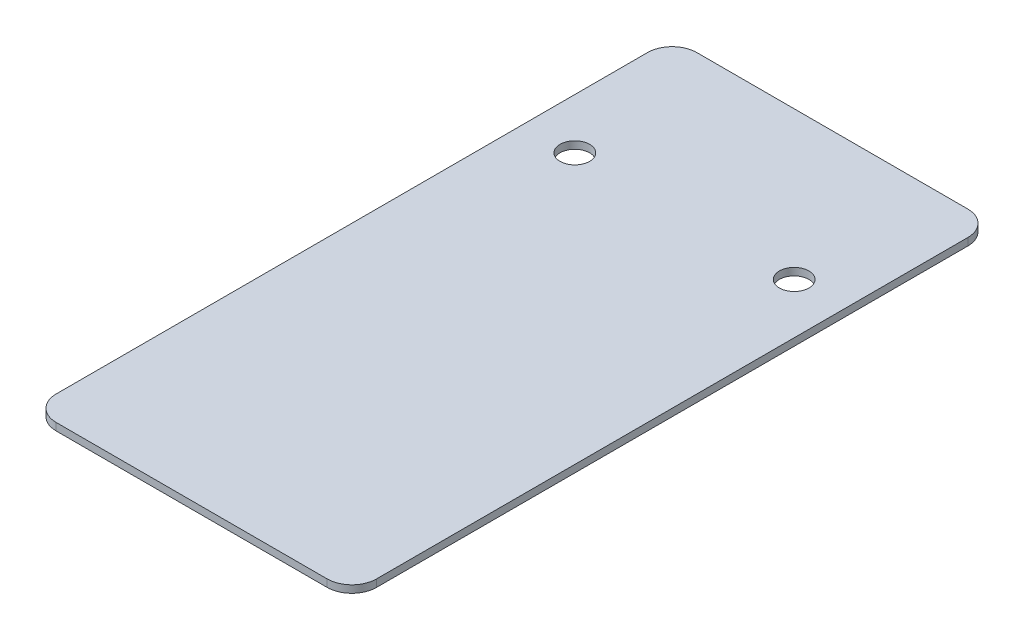
ISO-10303-21;
HEADER;
FILE_DESCRIPTION(('STEP AP214'),'2;1');
FILE_NAME('part.step','',(''),(''),'','','');
FILE_SCHEMA(('AUTOMOTIVE_DESIGN { 1 0 10303 214 1 1 1 1 }'));
ENDSEC;
DATA;
#1=APPLICATION_CONTEXT('core data for automotive mechanical design processes');
#2=APPLICATION_PROTOCOL_DEFINITION('international standard','automotive_design',2000,#1);
#3=PRODUCT_CONTEXT('',#1,'mechanical');
#4=PRODUCT('Part','Part','',(#3));
#5=PRODUCT_RELATED_PRODUCT_CATEGORY('part','',(#4));
#6=PRODUCT_DEFINITION_FORMATION('','',#4);
#7=PRODUCT_DEFINITION_CONTEXT('part definition',#1,'design');
#8=PRODUCT_DEFINITION('design','',#6,#7);
#9=PRODUCT_DEFINITION_SHAPE('','',#8);
#10=(LENGTH_UNIT() NAMED_UNIT(*) SI_UNIT(.MILLI.,.METRE.));
#11=(NAMED_UNIT(*) PLANE_ANGLE_UNIT() SI_UNIT($,.RADIAN.));
#12=(NAMED_UNIT(*) SI_UNIT($,.STERADIAN.) SOLID_ANGLE_UNIT());
#13=UNCERTAINTY_MEASURE_WITH_UNIT(LENGTH_MEASURE(1.E-05),#10,'distance_accuracy_value','');
#14=(GEOMETRIC_REPRESENTATION_CONTEXT(3) GLOBAL_UNCERTAINTY_ASSIGNED_CONTEXT((#13)) GLOBAL_UNIT_ASSIGNED_CONTEXT((#10,
#11,#12)) REPRESENTATION_CONTEXT('',''));
#15=CARTESIAN_POINT('',(0.,0.,0.));
#16=DIRECTION('',(0.,0.,1.));
#17=DIRECTION('',(1.,0.,0.));
#18=AXIS2_PLACEMENT_3D('',#15,#16,#17);
#19=CARTESIAN_POINT('',(65.,3.,60.));
#20=DIRECTION('',(-1.,0.,0.));
#21=DIRECTION('',(0.,0.,1.));
#22=AXIS2_PLACEMENT_3D('',#19,#20,#21);
#23=PLANE('',#22);
#24=DIRECTION('',(0.,0.,-1.));
#25=VECTOR('',#24,1.);
#26=CARTESIAN_POINT('',(65.,3.,60.));
#27=LINE('',#26,#25);
#28=CARTESIAN_POINT('',(65.,3.,190.));
#29=VERTEX_POINT('',#28);
#30=CARTESIAN_POINT('',(65.,3.,-50.));
#31=VERTEX_POINT('',#30);
#32=EDGE_CURVE('E143',#29,#31,#27,.T.);
#33=ORIENTED_EDGE('',*,*,#32,.F.);
#34=DIRECTION('',(0.,1.,0.));
#35=VECTOR('',#34,1.);
#36=CARTESIAN_POINT('',(65.,0.,190.));
#37=LINE('',#36,#35);
#38=CARTESIAN_POINT('',(65.,0.,190.));
#39=VERTEX_POINT('',#38);
#40=EDGE_CURVE('E173',#29,#39,#37,.F.);
#41=ORIENTED_EDGE('',*,*,#40,.T.);
#42=DIRECTION('',(0.,0.,-1.));
#43=VECTOR('',#42,1.);
#44=CARTESIAN_POINT('',(65.,0.,60.));
#45=LINE('',#44,#43);
#46=CARTESIAN_POINT('',(65.,0.,-50.));
#47=VERTEX_POINT('',#46);
#48=EDGE_CURVE('E142',#39,#47,#45,.T.);
#49=ORIENTED_EDGE('',*,*,#48,.T.);
#50=DIRECTION('',(0.,-1.,0.));
#51=VECTOR('',#50,1.);
#52=CARTESIAN_POINT('',(65.,3.,-50.));
#53=LINE('',#52,#51);
#54=EDGE_CURVE('E171',#47,#31,#53,.F.);
#55=ORIENTED_EDGE('',*,*,#54,.T.);
#56=EDGE_LOOP('',(#33,#41,#49,#55));
#57=FACE_BOUND('',#56,.T.);
#58=ADVANCED_FACE('F33',(#57),#23,.F.);
#59=CARTESIAN_POINT('',(-65.,3.,-60.));
#60=DIRECTION('',(0.,0.,1.));
#61=DIRECTION('',(1.,0.,0.));
#62=AXIS2_PLACEMENT_3D('',#59,#60,#61);
#63=PLANE('',#62);
#64=DIRECTION('',(-1.,0.,0.));
#65=VECTOR('',#64,1.);
#66=CARTESIAN_POINT('',(-65.,3.,-60.));
#67=LINE('',#66,#65);
#68=CARTESIAN_POINT('',(55.,3.,-60.));
#69=VERTEX_POINT('',#68);
#70=CARTESIAN_POINT('',(-55.,3.,-60.));
#71=VERTEX_POINT('',#70);
#72=EDGE_CURVE('E145',#69,#71,#67,.T.);
#73=ORIENTED_EDGE('',*,*,#72,.F.);
#74=DIRECTION('',(0.,-1.,0.));
#75=VECTOR('',#74,1.);
#76=CARTESIAN_POINT('',(55.,3.,-60.));
#77=LINE('',#76,#75);
#78=CARTESIAN_POINT('',(55.,0.,-60.));
#79=VERTEX_POINT('',#78);
#80=EDGE_CURVE('E11',#69,#79,#77,.T.);
#81=ORIENTED_EDGE('',*,*,#80,.T.);
#82=DIRECTION('',(-1.,0.,0.));
#83=VECTOR('',#82,1.);
#84=CARTESIAN_POINT('',(-65.,0.,-60.));
#85=LINE('',#84,#83);
#86=CARTESIAN_POINT('',(-55.,0.,-60.));
#87=VERTEX_POINT('',#86);
#88=EDGE_CURVE('E153',#79,#87,#85,.T.);
#89=ORIENTED_EDGE('',*,*,#88,.T.);
#90=DIRECTION('',(0.,-1.,0.));
#91=VECTOR('',#90,1.);
#92=CARTESIAN_POINT('',(-55.,3.,-60.));
#93=LINE('',#92,#91);
#94=EDGE_CURVE('E41',#87,#71,#93,.F.);
#95=ORIENTED_EDGE('',*,*,#94,.T.);
#96=EDGE_LOOP('',(#73,#81,#89,#95));
#97=FACE_BOUND('',#96,.T.);
#98=ADVANCED_FACE('F188',(#97),#63,.F.);
#99=CARTESIAN_POINT('',(-65.,3.,60.));
#100=DIRECTION('',(1.,0.,0.));
#101=DIRECTION('',(0.,0.,-1.));
#102=AXIS2_PLACEMENT_3D('',#99,#100,#101);
#103=PLANE('',#102);
#104=DIRECTION('',(0.,0.,1.));
#105=VECTOR('',#104,1.);
#106=CARTESIAN_POINT('',(-65.,0.,60.));
#107=LINE('',#106,#105);
#108=CARTESIAN_POINT('',(-65.,0.,-50.));
#109=VERTEX_POINT('',#108);
#110=CARTESIAN_POINT('',(-65.,0.,190.));
#111=VERTEX_POINT('',#110);
#112=EDGE_CURVE('E146',#109,#111,#107,.T.);
#113=ORIENTED_EDGE('',*,*,#112,.T.);
#114=DIRECTION('',(0.,-1.,0.));
#115=VECTOR('',#114,1.);
#116=CARTESIAN_POINT('',(-65.,3.,190.));
#117=LINE('',#116,#115);
#118=CARTESIAN_POINT('',(-65.,3.,190.));
#119=VERTEX_POINT('',#118);
#120=EDGE_CURVE('E104',#111,#119,#117,.F.);
#121=ORIENTED_EDGE('',*,*,#120,.T.);
#122=DIRECTION('',(0.,0.,1.));
#123=VECTOR('',#122,1.);
#124=CARTESIAN_POINT('',(-65.,3.,60.));
#125=LINE('',#124,#123);
#126=CARTESIAN_POINT('',(-65.,3.,-50.));
#127=VERTEX_POINT('',#126);
#128=EDGE_CURVE('E148',#127,#119,#125,.T.);
#129=ORIENTED_EDGE('',*,*,#128,.F.);
#130=DIRECTION('',(0.,-1.,0.));
#131=VECTOR('',#130,1.);
#132=CARTESIAN_POINT('',(-65.,3.,-50.));
#133=LINE('',#132,#131);
#134=EDGE_CURVE('E109',#127,#109,#133,.T.);
#135=ORIENTED_EDGE('',*,*,#134,.T.);
#136=EDGE_LOOP('',(#113,#121,#129,#135));
#137=FACE_BOUND('',#136,.T.);
#138=ADVANCED_FACE('F186',(#137),#103,.F.);
#139=CARTESIAN_POINT('',(0.,3.,0.));
#140=DIRECTION('',(0.,-1.,0.));
#141=DIRECTION('',(0.,0.,-1.));
#142=AXIS2_PLACEMENT_3D('',#139,#140,#141);
#143=PLANE('',#142);
#144=CARTESIAN_POINT('',(-44.5,3.,0.));
#145=DIRECTION('',(0.,-1.,0.));
#146=DIRECTION('',(0.,0.,-1.));
#147=AXIS2_PLACEMENT_3D('',#144,#145,#146);
#148=CIRCLE('',#147,6.);
#149=CARTESIAN_POINT('',(-44.5,3.,-6.));
#150=VERTEX_POINT('',#149);
#151=EDGE_CURVE('E133',#150,#150,#148,.F.);
#152=ORIENTED_EDGE('',*,*,#151,.F.);
#153=EDGE_LOOP('',(#152));
#154=FACE_BOUND('',#153,.T.);
#155=CARTESIAN_POINT('',(44.5,3.,0.));
#156=DIRECTION('',(0.,-1.,0.));
#157=DIRECTION('',(0.,0.,-1.));
#158=AXIS2_PLACEMENT_3D('',#155,#156,#157);
#159=CIRCLE('',#158,6.);
#160=CARTESIAN_POINT('',(44.5,3.,-6.));
#161=VERTEX_POINT('',#160);
#162=EDGE_CURVE('E139',#161,#161,#159,.T.);
#163=ORIENTED_EDGE('',*,*,#162,.T.);
#164=EDGE_LOOP('',(#163));
#165=FACE_BOUND('',#164,.T.);
#166=ORIENTED_EDGE('',*,*,#128,.T.);
#167=CARTESIAN_POINT('',(-55.,3.,190.));
#168=DIRECTION('',(0.,-1.,0.));
#169=DIRECTION('',(0.,0.,-1.));
#170=AXIS2_PLACEMENT_3D('',#167,#168,#169);
#171=CIRCLE('',#170,10.);
#172=CARTESIAN_POINT('',(-55.,3.,200.));
#173=VERTEX_POINT('',#172);
#174=EDGE_CURVE('E169',#119,#173,#171,.F.);
#175=ORIENTED_EDGE('',*,*,#174,.T.);
#176=DIRECTION('',(-1.,0.,0.));
#177=VECTOR('',#176,1.);
#178=CARTESIAN_POINT('',(65.,3.,200.));
#179=LINE('',#178,#177);
#180=CARTESIAN_POINT('',(55.,3.,200.));
#181=VERTEX_POINT('',#180);
#182=EDGE_CURVE('E120',#181,#173,#179,.T.);
#183=ORIENTED_EDGE('',*,*,#182,.F.);
#184=CARTESIAN_POINT('',(55.,3.,190.));
#185=DIRECTION('',(0.,-1.,0.));
#186=DIRECTION('',(0.,0.,-1.));
#187=AXIS2_PLACEMENT_3D('',#184,#185,#186);
#188=CIRCLE('',#187,10.);
#189=EDGE_CURVE('E167',#181,#29,#188,.F.);
#190=ORIENTED_EDGE('',*,*,#189,.T.);
#191=ORIENTED_EDGE('',*,*,#32,.T.);
#192=CARTESIAN_POINT('',(55.,3.,-50.));
#193=DIRECTION('',(0.,-1.,0.));
#194=DIRECTION('',(0.,0.,-1.));
#195=AXIS2_PLACEMENT_3D('',#192,#193,#194);
#196=CIRCLE('',#195,10.);
#197=EDGE_CURVE('E54',#31,#69,#196,.F.);
#198=ORIENTED_EDGE('',*,*,#197,.T.);
#199=ORIENTED_EDGE('',*,*,#72,.T.);
#200=CARTESIAN_POINT('',(-55.,3.,-50.));
#201=DIRECTION('',(0.,-1.,0.));
#202=DIRECTION('',(0.,0.,-1.));
#203=AXIS2_PLACEMENT_3D('',#200,#201,#202);
#204=CIRCLE('',#203,10.);
#205=EDGE_CURVE('E164',#71,#127,#204,.F.);
#206=ORIENTED_EDGE('',*,*,#205,.T.);
#207=EDGE_LOOP('',(#166,#175,#183,#190,#191,#198,#199,#206));
#208=FACE_BOUND('',#207,.T.);
#209=ADVANCED_FACE('F181',(#154,#165,#208),#143,.F.);
#210=CARTESIAN_POINT('',(0.,0.,0.));
#211=DIRECTION('',(0.,-1.,0.));
#212=DIRECTION('',(0.,0.,-1.));
#213=AXIS2_PLACEMENT_3D('',#210,#211,#212);
#214=PLANE('',#213);
#215=CARTESIAN_POINT('',(-44.5,0.,0.));
#216=DIRECTION('',(0.,-1.,0.));
#217=DIRECTION('',(0.,0.,1.));
#218=AXIS2_PLACEMENT_3D('',#215,#216,#217);
#219=CIRCLE('',#218,6.);
#220=CARTESIAN_POINT('',(-44.5,0.,6.));
#221=VERTEX_POINT('',#220);
#222=EDGE_CURVE('E128',#221,#221,#219,.T.);
#223=ORIENTED_EDGE('',*,*,#222,.F.);
#224=EDGE_LOOP('',(#223));
#225=FACE_BOUND('',#224,.T.);
#226=CARTESIAN_POINT('',(44.5,0.,0.));
#227=DIRECTION('',(0.,1.,0.));
#228=DIRECTION('',(0.,0.,1.));
#229=AXIS2_PLACEMENT_3D('',#226,#227,#228);
#230=CIRCLE('',#229,6.);
#231=CARTESIAN_POINT('',(44.5,0.,6.));
#232=VERTEX_POINT('',#231);
#233=EDGE_CURVE('E136',#232,#232,#230,.T.);
#234=ORIENTED_EDGE('',*,*,#233,.T.);
#235=EDGE_LOOP('',(#234));
#236=FACE_BOUND('',#235,.T.);
#237=DIRECTION('',(1.,0.,0.));
#238=VECTOR('',#237,1.);
#239=CARTESIAN_POINT('',(-65.,0.,200.));
#240=LINE('',#239,#238);
#241=CARTESIAN_POINT('',(-55.,0.,200.));
#242=VERTEX_POINT('',#241);
#243=CARTESIAN_POINT('',(55.,0.,200.));
#244=VERTEX_POINT('',#243);
#245=EDGE_CURVE('E117',#242,#244,#240,.T.);
#246=ORIENTED_EDGE('',*,*,#245,.F.);
#247=CARTESIAN_POINT('',(-55.,0.,190.));
#248=DIRECTION('',(0.,-1.,0.));
#249=DIRECTION('',(0.,0.,-1.));
#250=AXIS2_PLACEMENT_3D('',#247,#248,#249);
#251=CIRCLE('',#250,10.);
#252=EDGE_CURVE('E99',#242,#111,#251,.T.);
#253=ORIENTED_EDGE('',*,*,#252,.T.);
#254=ORIENTED_EDGE('',*,*,#112,.F.);
#255=CARTESIAN_POINT('',(-55.,0.,-50.));
#256=DIRECTION('',(0.,-1.,0.));
#257=DIRECTION('',(0.,0.,-1.));
#258=AXIS2_PLACEMENT_3D('',#255,#256,#257);
#259=CIRCLE('',#258,10.);
#260=EDGE_CURVE('E121',#109,#87,#259,.T.);
#261=ORIENTED_EDGE('',*,*,#260,.T.);
#262=ORIENTED_EDGE('',*,*,#88,.F.);
#263=CARTESIAN_POINT('',(55.,0.,-50.));
#264=DIRECTION('',(0.,-1.,0.));
#265=DIRECTION('',(0.,0.,-1.));
#266=AXIS2_PLACEMENT_3D('',#263,#264,#265);
#267=CIRCLE('',#266,10.);
#268=EDGE_CURVE('E158',#79,#47,#267,.T.);
#269=ORIENTED_EDGE('',*,*,#268,.T.);
#270=ORIENTED_EDGE('',*,*,#48,.F.);
#271=CARTESIAN_POINT('',(55.,0.,190.));
#272=DIRECTION('',(0.,-1.,0.));
#273=DIRECTION('',(0.,0.,-1.));
#274=AXIS2_PLACEMENT_3D('',#271,#272,#273);
#275=CIRCLE('',#274,10.);
#276=EDGE_CURVE('E110',#39,#244,#275,.T.);
#277=ORIENTED_EDGE('',*,*,#276,.T.);
#278=EDGE_LOOP('',(#246,#253,#254,#261,#262,#269,#270,#277));
#279=FACE_BOUND('',#278,.T.);
#280=ADVANCED_FACE('F124',(#225,#236,#279),#214,.T.);
#281=CARTESIAN_POINT('',(44.5,0.,0.));
#282=DIRECTION('',(0.,1.,0.));
#283=DIRECTION('',(0.,0.,1.));
#284=AXIS2_PLACEMENT_3D('',#281,#282,#283);
#285=CYLINDRICAL_SURFACE('',#284,6.);
#286=ORIENTED_EDGE('',*,*,#233,.F.);
#287=EDGE_LOOP('',(#286));
#288=FACE_BOUND('',#287,.T.);
#289=ORIENTED_EDGE('',*,*,#162,.F.);
#290=EDGE_LOOP('',(#289));
#291=FACE_BOUND('',#290,.T.);
#292=ADVANCED_FACE('F217',(#288,#291),#285,.F.);
#293=CARTESIAN_POINT('',(-44.5,0.,0.));
#294=DIRECTION('',(0.,1.,0.));
#295=DIRECTION('',(0.,0.,1.));
#296=AXIS2_PLACEMENT_3D('',#293,#294,#295);
#297=CYLINDRICAL_SURFACE('',#296,6.);
#298=ORIENTED_EDGE('',*,*,#222,.T.);
#299=EDGE_LOOP('',(#298));
#300=FACE_BOUND('',#299,.T.);
#301=ORIENTED_EDGE('',*,*,#151,.T.);
#302=EDGE_LOOP('',(#301));
#303=FACE_BOUND('',#302,.T.);
#304=ADVANCED_FACE('F212',(#300,#303),#297,.F.);
#305=CARTESIAN_POINT('',(0.,0.,200.));
#306=DIRECTION('',(0.,0.,1.));
#307=DIRECTION('',(1.,0.,0.));
#308=AXIS2_PLACEMENT_3D('',#305,#306,#307);
#309=PLANE('',#308);
#310=ORIENTED_EDGE('',*,*,#182,.T.);
#311=DIRECTION('',(0.,-1.,0.));
#312=VECTOR('',#311,1.);
#313=CARTESIAN_POINT('',(-55.,0.,200.));
#314=LINE('',#313,#312);
#315=EDGE_CURVE('E103',#173,#242,#314,.T.);
#316=ORIENTED_EDGE('',*,*,#315,.T.);
#317=ORIENTED_EDGE('',*,*,#245,.T.);
#318=DIRECTION('',(0.,1.,0.));
#319=VECTOR('',#318,1.);
#320=CARTESIAN_POINT('',(55.,3.,200.));
#321=LINE('',#320,#319);
#322=EDGE_CURVE('E122',#244,#181,#321,.T.);
#323=ORIENTED_EDGE('',*,*,#322,.T.);
#324=EDGE_LOOP('',(#310,#316,#317,#323));
#325=FACE_BOUND('',#324,.T.);
#326=ADVANCED_FACE('F115',(#325),#309,.T.);
#327=CARTESIAN_POINT('',(-55.,0.,190.));
#328=DIRECTION('',(0.,1.,0.));
#329=DIRECTION('',(0.,0.,1.));
#330=AXIS2_PLACEMENT_3D('',#327,#328,#329);
#331=CYLINDRICAL_SURFACE('',#330,10.);
#332=ORIENTED_EDGE('',*,*,#174,.F.);
#333=ORIENTED_EDGE('',*,*,#120,.F.);
#334=ORIENTED_EDGE('',*,*,#252,.F.);
#335=ORIENTED_EDGE('',*,*,#315,.F.);
#336=EDGE_LOOP('',(#332,#333,#334,#335));
#337=FACE_BOUND('',#336,.T.);
#338=ADVANCED_FACE('F102',(#337),#331,.T.);
#339=CARTESIAN_POINT('',(55.,0.,190.));
#340=DIRECTION('',(0.,-1.,0.));
#341=DIRECTION('',(0.,0.,-1.));
#342=AXIS2_PLACEMENT_3D('',#339,#340,#341);
#343=CYLINDRICAL_SURFACE('',#342,10.);
#344=ORIENTED_EDGE('',*,*,#276,.F.);
#345=ORIENTED_EDGE('',*,*,#40,.F.);
#346=ORIENTED_EDGE('',*,*,#189,.F.);
#347=ORIENTED_EDGE('',*,*,#322,.F.);
#348=EDGE_LOOP('',(#344,#345,#346,#347));
#349=FACE_BOUND('',#348,.T.);
#350=ADVANCED_FACE('F180',(#349),#343,.T.);
#351=CARTESIAN_POINT('',(55.,3.,-50.));
#352=DIRECTION('',(0.,-1.,0.));
#353=DIRECTION('',(0.,0.,-1.));
#354=AXIS2_PLACEMENT_3D('',#351,#352,#353);
#355=CYLINDRICAL_SURFACE('',#354,10.);
#356=ORIENTED_EDGE('',*,*,#197,.F.);
#357=ORIENTED_EDGE('',*,*,#54,.F.);
#358=ORIENTED_EDGE('',*,*,#268,.F.);
#359=ORIENTED_EDGE('',*,*,#80,.F.);
#360=EDGE_LOOP('',(#356,#357,#358,#359));
#361=FACE_BOUND('',#360,.T.);
#362=ADVANCED_FACE('F191',(#361),#355,.T.);
#363=CARTESIAN_POINT('',(-55.,3.,-50.));
#364=DIRECTION('',(0.,-1.,0.));
#365=DIRECTION('',(0.,0.,-1.));
#366=AXIS2_PLACEMENT_3D('',#363,#364,#365);
#367=CYLINDRICAL_SURFACE('',#366,10.);
#368=ORIENTED_EDGE('',*,*,#205,.F.);
#369=ORIENTED_EDGE('',*,*,#94,.F.);
#370=ORIENTED_EDGE('',*,*,#260,.F.);
#371=ORIENTED_EDGE('',*,*,#134,.F.);
#372=EDGE_LOOP('',(#368,#369,#370,#371));
#373=FACE_BOUND('',#372,.T.);
#374=ADVANCED_FACE('F35',(#373),#367,.T.);
#375=CLOSED_SHELL('',(#58,#98,#138,#209,#280,#292,#304,#326,#338,#350,#362,#374));
#376=MANIFOLD_SOLID_BREP('B2',#375);
#377=ADVANCED_BREP_SHAPE_REPRESENTATION('',(#18,#376),#14);
#378=SHAPE_DEFINITION_REPRESENTATION(#9,#377);
ENDSEC;
END-ISO-10303-21;
